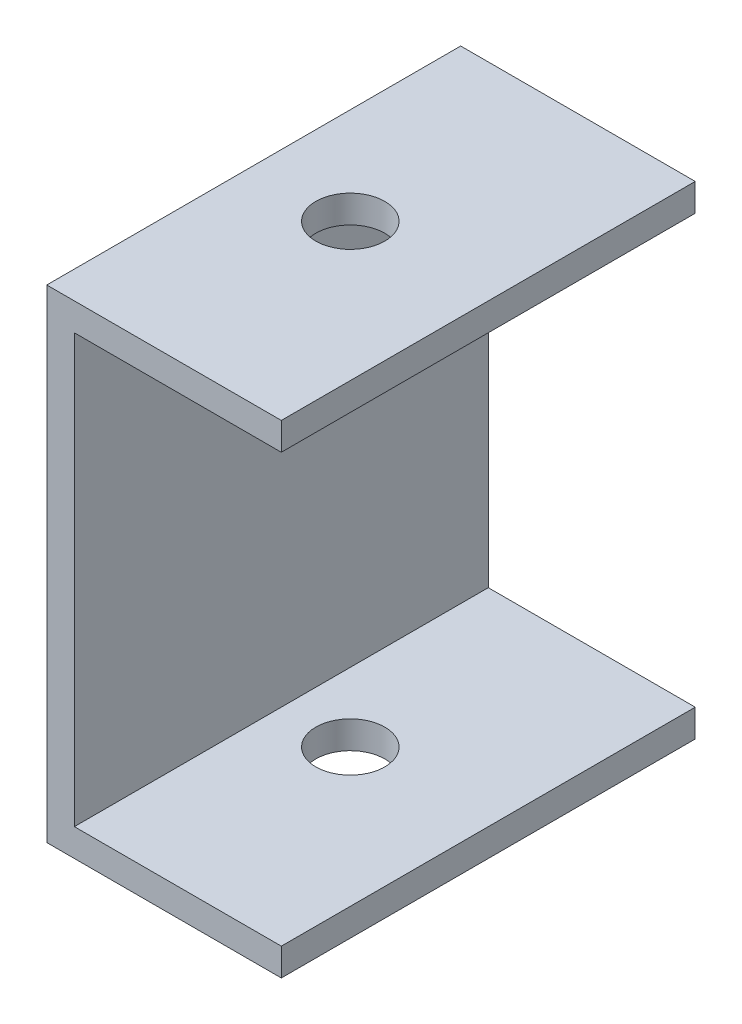
ISO-10303-21;
HEADER;
FILE_DESCRIPTION(('STEP AP214'),'2;1');
FILE_NAME('part.step','',(''),(''),'','','');
FILE_SCHEMA(('AUTOMOTIVE_DESIGN { 1 0 10303 214 1 1 1 1 }'));
ENDSEC;
DATA;
#1=APPLICATION_CONTEXT('core data for automotive mechanical design processes');
#2=APPLICATION_PROTOCOL_DEFINITION('international standard','automotive_design',2000,#1);
#3=PRODUCT_CONTEXT('',#1,'mechanical');
#4=PRODUCT('Part','Part','',(#3));
#5=PRODUCT_RELATED_PRODUCT_CATEGORY('part','',(#4));
#6=PRODUCT_DEFINITION_FORMATION('','',#4);
#7=PRODUCT_DEFINITION_CONTEXT('part definition',#1,'design');
#8=PRODUCT_DEFINITION('design','',#6,#7);
#9=PRODUCT_DEFINITION_SHAPE('','',#8);
#10=(LENGTH_UNIT() NAMED_UNIT(*) SI_UNIT(.MILLI.,.METRE.));
#11=(NAMED_UNIT(*) PLANE_ANGLE_UNIT() SI_UNIT($,.RADIAN.));
#12=(NAMED_UNIT(*) SI_UNIT($,.STERADIAN.) SOLID_ANGLE_UNIT());
#13=UNCERTAINTY_MEASURE_WITH_UNIT(LENGTH_MEASURE(1.E-05),#10,'distance_accuracy_value','');
#14=(GEOMETRIC_REPRESENTATION_CONTEXT(3) GLOBAL_UNCERTAINTY_ASSIGNED_CONTEXT((#13)) GLOBAL_UNIT_ASSIGNED_CONTEXT((#10,
#11,#12)) REPRESENTATION_CONTEXT('',''));
#15=CARTESIAN_POINT('',(0.,0.,0.));
#16=DIRECTION('',(0.,0.,1.));
#17=DIRECTION('',(1.,0.,0.));
#18=AXIS2_PLACEMENT_3D('',#15,#16,#17);
#19=CARTESIAN_POINT('',(17.,0.,30.));
#20=DIRECTION('',(0.,1.,0.));
#21=DIRECTION('',(-1.,0.,0.));
#22=AXIS2_PLACEMENT_3D('',#19,#20,#21);
#23=PLANE('',#22);
#24=CARTESIAN_POINT('',(7.,0.,15.));
#25=DIRECTION('',(0.,1.,0.));
#26=DIRECTION('',(-1.,0.,0.));
#27=AXIS2_PLACEMENT_3D('',#24,#25,#26);
#28=CIRCLE('',#27,2.5);
#29=CARTESIAN_POINT('',(4.5,0.,15.));
#30=VERTEX_POINT('',#29);
#31=EDGE_CURVE('E172',#30,#30,#28,.T.);
#32=ORIENTED_EDGE('',*,*,#31,.T.);
#33=EDGE_LOOP('',(#32));
#34=FACE_BOUND('',#33,.T.);
#35=DIRECTION('',(1.,0.,0.));
#36=VECTOR('',#35,1.);
#37=CARTESIAN_POINT('',(17.,0.,0.));
#38=LINE('',#37,#36);
#39=CARTESIAN_POINT('',(0.,0.,0.));
#40=VERTEX_POINT('',#39);
#41=CARTESIAN_POINT('',(17.,0.,0.));
#42=VERTEX_POINT('',#41);
#43=EDGE_CURVE('E176',#40,#42,#38,.T.);
#44=ORIENTED_EDGE('',*,*,#43,.T.);
#45=DIRECTION('',(0.,0.,-1.));
#46=VECTOR('',#45,1.);
#47=CARTESIAN_POINT('',(17.,0.,30.));
#48=LINE('',#47,#46);
#49=CARTESIAN_POINT('',(17.,0.,30.));
#50=VERTEX_POINT('',#49);
#51=EDGE_CURVE('E11',#50,#42,#48,.T.);
#52=ORIENTED_EDGE('',*,*,#51,.F.);
#53=DIRECTION('',(1.,0.,0.));
#54=VECTOR('',#53,1.);
#55=CARTESIAN_POINT('',(17.,0.,30.));
#56=LINE('',#55,#54);
#57=CARTESIAN_POINT('',(0.,0.,30.));
#58=VERTEX_POINT('',#57);
#59=EDGE_CURVE('E177',#58,#50,#56,.T.);
#60=ORIENTED_EDGE('',*,*,#59,.F.);
#61=DIRECTION('',(0.,0.,-1.));
#62=VECTOR('',#61,1.);
#63=CARTESIAN_POINT('',(0.,0.,30.));
#64=LINE('',#63,#62);
#65=EDGE_CURVE('E114',#58,#40,#64,.T.);
#66=ORIENTED_EDGE('',*,*,#65,.T.);
#67=EDGE_LOOP('',(#44,#52,#60,#66));
#68=FACE_BOUND('',#67,.T.);
#69=ADVANCED_FACE('F38',(#34,#68),#23,.F.);
#70=CARTESIAN_POINT('',(17.,2.,30.));
#71=DIRECTION('',(-1.,0.,0.));
#72=DIRECTION('',(0.,0.,1.));
#73=AXIS2_PLACEMENT_3D('',#70,#71,#72);
#74=PLANE('',#73);
#75=DIRECTION('',(0.,1.,0.));
#76=VECTOR('',#75,1.);
#77=CARTESIAN_POINT('',(17.,2.,0.));
#78=LINE('',#77,#76);
#79=CARTESIAN_POINT('',(17.,2.,0.));
#80=VERTEX_POINT('',#79);
#81=EDGE_CURVE('E190',#42,#80,#78,.T.);
#82=ORIENTED_EDGE('',*,*,#81,.T.);
#83=DIRECTION('',(0.,0.,-1.));
#84=VECTOR('',#83,1.);
#85=CARTESIAN_POINT('',(17.,2.,30.));
#86=LINE('',#85,#84);
#87=CARTESIAN_POINT('',(17.,2.,30.));
#88=VERTEX_POINT('',#87);
#89=EDGE_CURVE('E48',#88,#80,#86,.T.);
#90=ORIENTED_EDGE('',*,*,#89,.F.);
#91=DIRECTION('',(0.,1.,0.));
#92=VECTOR('',#91,1.);
#93=CARTESIAN_POINT('',(17.,2.,30.));
#94=LINE('',#93,#92);
#95=EDGE_CURVE('E89',#50,#88,#94,.T.);
#96=ORIENTED_EDGE('',*,*,#95,.F.);
#97=ORIENTED_EDGE('',*,*,#51,.T.);
#98=EDGE_LOOP('',(#82,#90,#96,#97));
#99=FACE_BOUND('',#98,.T.);
#100=ADVANCED_FACE('F226',(#99),#74,.F.);
#101=CARTESIAN_POINT('',(2.,2.,30.));
#102=DIRECTION('',(0.,-1.,0.));
#103=DIRECTION('',(1.,0.,0.));
#104=AXIS2_PLACEMENT_3D('',#101,#102,#103);
#105=PLANE('',#104);
#106=CARTESIAN_POINT('',(7.,2.,15.));
#107=DIRECTION('',(0.,1.,0.));
#108=DIRECTION('',(-1.,0.,0.));
#109=AXIS2_PLACEMENT_3D('',#106,#107,#108);
#110=CIRCLE('',#109,2.5);
#111=CARTESIAN_POINT('',(4.5,2.,15.));
#112=VERTEX_POINT('',#111);
#113=EDGE_CURVE('E168',#112,#112,#110,.T.);
#114=ORIENTED_EDGE('',*,*,#113,.F.);
#115=EDGE_LOOP('',(#114));
#116=FACE_BOUND('',#115,.T.);
#117=DIRECTION('',(-1.,0.,0.));
#118=VECTOR('',#117,1.);
#119=CARTESIAN_POINT('',(2.,2.,0.));
#120=LINE('',#119,#118);
#121=CARTESIAN_POINT('',(2.,2.,0.));
#122=VERTEX_POINT('',#121);
#123=EDGE_CURVE('E75',#80,#122,#120,.T.);
#124=ORIENTED_EDGE('',*,*,#123,.T.);
#125=DIRECTION('',(0.,0.,-1.));
#126=VECTOR('',#125,1.);
#127=CARTESIAN_POINT('',(2.,2.,30.));
#128=LINE('',#127,#126);
#129=CARTESIAN_POINT('',(2.,2.,30.));
#130=VERTEX_POINT('',#129);
#131=EDGE_CURVE('E202',#130,#122,#128,.T.);
#132=ORIENTED_EDGE('',*,*,#131,.F.);
#133=DIRECTION('',(-1.,0.,0.));
#134=VECTOR('',#133,1.);
#135=CARTESIAN_POINT('',(2.,2.,30.));
#136=LINE('',#135,#134);
#137=EDGE_CURVE('E182',#88,#130,#136,.T.);
#138=ORIENTED_EDGE('',*,*,#137,.F.);
#139=ORIENTED_EDGE('',*,*,#89,.T.);
#140=EDGE_LOOP('',(#124,#132,#138,#139));
#141=FACE_BOUND('',#140,.T.);
#142=ADVANCED_FACE('F207',(#116,#141),#105,.F.);
#143=CARTESIAN_POINT('',(2.,28.,30.));
#144=DIRECTION('',(-1.,0.,0.));
#145=DIRECTION('',(0.,-1.,0.));
#146=AXIS2_PLACEMENT_3D('',#143,#144,#145);
#147=PLANE('',#146);
#148=CARTESIAN_POINT('',(2.,23.,15.));
#149=DIRECTION('',(1.,0.,0.));
#150=DIRECTION('',(0.,1.,0.));
#151=AXIS2_PLACEMENT_3D('',#148,#149,#150);
#152=CIRCLE('',#151,2.5);
#153=CARTESIAN_POINT('',(2.,25.5,15.));
#154=VERTEX_POINT('',#153);
#155=EDGE_CURVE('E164',#154,#154,#152,.T.);
#156=ORIENTED_EDGE('',*,*,#155,.F.);
#157=EDGE_LOOP('',(#156));
#158=FACE_BOUND('',#157,.T.);
#159=DIRECTION('',(0.,1.,0.));
#160=VECTOR('',#159,1.);
#161=CARTESIAN_POINT('',(2.,28.,0.));
#162=LINE('',#161,#160);
#163=CARTESIAN_POINT('',(1.99999999999999,33.,0.));
#164=VERTEX_POINT('',#163);
#165=EDGE_CURVE('E195',#122,#164,#162,.T.);
#166=ORIENTED_EDGE('',*,*,#165,.T.);
#167=DIRECTION('',(0.,0.,-1.));
#168=VECTOR('',#167,1.);
#169=CARTESIAN_POINT('',(2.,33.,0.));
#170=LINE('',#169,#168);
#171=CARTESIAN_POINT('',(2.,33.,30.));
#172=VERTEX_POINT('',#171);
#173=EDGE_CURVE('E160',#172,#164,#170,.T.);
#174=ORIENTED_EDGE('',*,*,#173,.F.);
#175=DIRECTION('',(0.,1.,0.));
#176=VECTOR('',#175,1.);
#177=CARTESIAN_POINT('',(2.,28.,30.));
#178=LINE('',#177,#176);
#179=EDGE_CURVE('E117',#130,#172,#178,.T.);
#180=ORIENTED_EDGE('',*,*,#179,.F.);
#181=ORIENTED_EDGE('',*,*,#131,.T.);
#182=EDGE_LOOP('',(#166,#174,#180,#181));
#183=FACE_BOUND('',#182,.T.);
#184=ADVANCED_FACE('F215',(#158,#183),#147,.F.);
#185=CARTESIAN_POINT('',(0.,0.,30.));
#186=DIRECTION('',(1.,0.,0.));
#187=DIRECTION('',(0.,1.,0.));
#188=AXIS2_PLACEMENT_3D('',#185,#186,#187);
#189=PLANE('',#188);
#190=CARTESIAN_POINT('',(0.,23.,15.));
#191=DIRECTION('',(1.,0.,0.));
#192=DIRECTION('',(0.,1.,0.));
#193=AXIS2_PLACEMENT_3D('',#190,#191,#192);
#194=CIRCLE('',#193,2.5);
#195=CARTESIAN_POINT('',(0.,25.5,15.));
#196=VERTEX_POINT('',#195);
#197=EDGE_CURVE('E41',#196,#196,#194,.T.);
#198=ORIENTED_EDGE('',*,*,#197,.T.);
#199=EDGE_LOOP('',(#198));
#200=FACE_BOUND('',#199,.T.);
#201=DIRECTION('',(0.,-1.,0.));
#202=VECTOR('',#201,1.);
#203=CARTESIAN_POINT('',(0.,0.,0.));
#204=LINE('',#203,#202);
#205=CARTESIAN_POINT('',(0.,35.,0.));
#206=VERTEX_POINT('',#205);
#207=EDGE_CURVE('E82',#206,#40,#204,.T.);
#208=ORIENTED_EDGE('',*,*,#207,.T.);
#209=ORIENTED_EDGE('',*,*,#65,.F.);
#210=DIRECTION('',(0.,-1.,0.));
#211=VECTOR('',#210,1.);
#212=CARTESIAN_POINT('',(0.,0.,30.));
#213=LINE('',#212,#211);
#214=CARTESIAN_POINT('',(0.,35.,30.));
#215=VERTEX_POINT('',#214);
#216=EDGE_CURVE('E56',#215,#58,#213,.T.);
#217=ORIENTED_EDGE('',*,*,#216,.F.);
#218=DIRECTION('',(0.,0.,1.));
#219=VECTOR('',#218,1.);
#220=CARTESIAN_POINT('',(0.,35.,0.));
#221=LINE('',#220,#219);
#222=EDGE_CURVE('E113',#206,#215,#221,.T.);
#223=ORIENTED_EDGE('',*,*,#222,.F.);
#224=EDGE_LOOP('',(#208,#209,#217,#223));
#225=FACE_BOUND('',#224,.T.);
#226=ADVANCED_FACE('F111',(#200,#225),#189,.F.);
#227=CARTESIAN_POINT('',(0.,0.,30.));
#228=DIRECTION('',(0.,0.,-1.));
#229=DIRECTION('',(-1.,0.,0.));
#230=AXIS2_PLACEMENT_3D('',#227,#228,#229);
#231=PLANE('',#230);
#232=ORIENTED_EDGE('',*,*,#59,.T.);
#233=ORIENTED_EDGE('',*,*,#95,.T.);
#234=ORIENTED_EDGE('',*,*,#137,.T.);
#235=ORIENTED_EDGE('',*,*,#179,.T.);
#236=DIRECTION('',(1.,0.,0.));
#237=VECTOR('',#236,1.);
#238=CARTESIAN_POINT('',(17.,33.,30.));
#239=LINE('',#238,#237);
#240=CARTESIAN_POINT('',(17.,33.,30.));
#241=VERTEX_POINT('',#240);
#242=EDGE_CURVE('E149',#172,#241,#239,.T.);
#243=ORIENTED_EDGE('',*,*,#242,.T.);
#244=DIRECTION('',(0.,-1.,0.));
#245=VECTOR('',#244,1.);
#246=CARTESIAN_POINT('',(17.,35.,30.));
#247=LINE('',#246,#245);
#248=CARTESIAN_POINT('',(17.,35.,30.));
#249=VERTEX_POINT('',#248);
#250=EDGE_CURVE('E123',#249,#241,#247,.T.);
#251=ORIENTED_EDGE('',*,*,#250,.F.);
#252=DIRECTION('',(1.,0.,0.));
#253=VECTOR('',#252,1.);
#254=CARTESIAN_POINT('',(17.,35.,30.));
#255=LINE('',#254,#253);
#256=EDGE_CURVE('E120',#215,#249,#255,.T.);
#257=ORIENTED_EDGE('',*,*,#256,.F.);
#258=ORIENTED_EDGE('',*,*,#216,.T.);
#259=EDGE_LOOP('',(#232,#233,#234,#235,#243,#251,#257,#258));
#260=FACE_BOUND('',#259,.T.);
#261=ADVANCED_FACE('F121',(#260),#231,.F.);
#262=CARTESIAN_POINT('',(0.,0.,0.));
#263=DIRECTION('',(0.,0.,-1.));
#264=DIRECTION('',(-1.,0.,0.));
#265=AXIS2_PLACEMENT_3D('',#262,#263,#264);
#266=PLANE('',#265);
#267=ORIENTED_EDGE('',*,*,#43,.F.);
#268=ORIENTED_EDGE('',*,*,#207,.F.);
#269=DIRECTION('',(-1.,0.,0.));
#270=VECTOR('',#269,1.);
#271=CARTESIAN_POINT('',(17.,35.,0.));
#272=LINE('',#271,#270);
#273=CARTESIAN_POINT('',(17.,35.,0.));
#274=VERTEX_POINT('',#273);
#275=EDGE_CURVE('E132',#274,#206,#272,.T.);
#276=ORIENTED_EDGE('',*,*,#275,.F.);
#277=DIRECTION('',(0.,-1.,0.));
#278=VECTOR('',#277,1.);
#279=CARTESIAN_POINT('',(17.,35.,0.));
#280=LINE('',#279,#278);
#281=CARTESIAN_POINT('',(17.,33.,0.));
#282=VERTEX_POINT('',#281);
#283=EDGE_CURVE('E148',#274,#282,#280,.T.);
#284=ORIENTED_EDGE('',*,*,#283,.T.);
#285=DIRECTION('',(-1.,0.,0.));
#286=VECTOR('',#285,1.);
#287=CARTESIAN_POINT('',(17.,33.,0.));
#288=LINE('',#287,#286);
#289=EDGE_CURVE('E134',#282,#164,#288,.T.);
#290=ORIENTED_EDGE('',*,*,#289,.T.);
#291=ORIENTED_EDGE('',*,*,#165,.F.);
#292=ORIENTED_EDGE('',*,*,#123,.F.);
#293=ORIENTED_EDGE('',*,*,#81,.F.);
#294=EDGE_LOOP('',(#267,#268,#276,#284,#290,#291,#292,#293));
#295=FACE_BOUND('',#294,.T.);
#296=ADVANCED_FACE('F211',(#295),#266,.T.);
#297=CARTESIAN_POINT('',(7.,-8.,15.));
#298=DIRECTION('',(0.,1.,0.));
#299=DIRECTION('',(-1.,0.,0.));
#300=AXIS2_PLACEMENT_3D('',#297,#298,#299);
#301=CYLINDRICAL_SURFACE('',#300,2.5);
#302=ORIENTED_EDGE('',*,*,#113,.T.);
#303=EDGE_LOOP('',(#302));
#304=FACE_BOUND('',#303,.T.);
#305=ORIENTED_EDGE('',*,*,#31,.F.);
#306=EDGE_LOOP('',(#305));
#307=FACE_BOUND('',#306,.T.);
#308=ADVANCED_FACE('F244',(#304,#307),#301,.F.);
#309=CARTESIAN_POINT('',(-8.,23.,15.));
#310=DIRECTION('',(1.,0.,0.));
#311=DIRECTION('',(0.,1.,0.));
#312=AXIS2_PLACEMENT_3D('',#309,#310,#311);
#313=CYLINDRICAL_SURFACE('',#312,2.5);
#314=ORIENTED_EDGE('',*,*,#155,.T.);
#315=EDGE_LOOP('',(#314));
#316=FACE_BOUND('',#315,.T.);
#317=ORIENTED_EDGE('',*,*,#197,.F.);
#318=EDGE_LOOP('',(#317));
#319=FACE_BOUND('',#318,.T.);
#320=ADVANCED_FACE('F249',(#316,#319),#313,.F.);
#321=CARTESIAN_POINT('',(17.,35.,0.));
#322=DIRECTION('',(-1.,0.,0.));
#323=DIRECTION('',(0.,0.,1.));
#324=AXIS2_PLACEMENT_3D('',#321,#322,#323);
#325=PLANE('',#324);
#326=DIRECTION('',(0.,0.,-1.));
#327=VECTOR('',#326,1.);
#328=CARTESIAN_POINT('',(17.,33.,0.));
#329=LINE('',#328,#327);
#330=EDGE_CURVE('E138',#241,#282,#329,.T.);
#331=ORIENTED_EDGE('',*,*,#330,.T.);
#332=ORIENTED_EDGE('',*,*,#283,.F.);
#333=DIRECTION('',(0.,0.,-1.));
#334=VECTOR('',#333,1.);
#335=CARTESIAN_POINT('',(17.,35.,0.));
#336=LINE('',#335,#334);
#337=EDGE_CURVE('E127',#249,#274,#336,.T.);
#338=ORIENTED_EDGE('',*,*,#337,.F.);
#339=ORIENTED_EDGE('',*,*,#250,.T.);
#340=EDGE_LOOP('',(#331,#332,#338,#339));
#341=FACE_BOUND('',#340,.T.);
#342=ADVANCED_FACE('F222',(#341),#325,.F.);
#343=CARTESIAN_POINT('',(0.,35.,0.));
#344=DIRECTION('',(0.,-1.,0.));
#345=DIRECTION('',(0.,0.,-1.));
#346=AXIS2_PLACEMENT_3D('',#343,#344,#345);
#347=PLANE('',#346);
#348=CARTESIAN_POINT('',(7.,35.,15.));
#349=DIRECTION('',(0.,-1.,0.));
#350=DIRECTION('',(0.,0.,-1.));
#351=AXIS2_PLACEMENT_3D('',#348,#349,#350);
#352=CIRCLE('',#351,2.5);
#353=CARTESIAN_POINT('',(7.,35.,12.5));
#354=VERTEX_POINT('',#353);
#355=EDGE_CURVE('E152',#354,#354,#352,.T.);
#356=ORIENTED_EDGE('',*,*,#355,.T.);
#357=EDGE_LOOP('',(#356));
#358=FACE_BOUND('',#357,.T.);
#359=ORIENTED_EDGE('',*,*,#222,.T.);
#360=ORIENTED_EDGE('',*,*,#256,.T.);
#361=ORIENTED_EDGE('',*,*,#337,.T.);
#362=ORIENTED_EDGE('',*,*,#275,.T.);
#363=EDGE_LOOP('',(#359,#360,#361,#362));
#364=FACE_BOUND('',#363,.T.);
#365=ADVANCED_FACE('F130',(#358,#364),#347,.F.);
#366=CARTESIAN_POINT('',(0.,33.,0.));
#367=DIRECTION('',(0.,-1.,0.));
#368=DIRECTION('',(0.,0.,-1.));
#369=AXIS2_PLACEMENT_3D('',#366,#367,#368);
#370=PLANE('',#369);
#371=CARTESIAN_POINT('',(7.,33.,15.));
#372=DIRECTION('',(0.,-1.,0.));
#373=DIRECTION('',(0.,0.,-1.));
#374=AXIS2_PLACEMENT_3D('',#371,#372,#373);
#375=CIRCLE('',#374,2.5);
#376=CARTESIAN_POINT('',(7.,33.,12.5));
#377=VERTEX_POINT('',#376);
#378=EDGE_CURVE('E141',#377,#377,#375,.T.);
#379=ORIENTED_EDGE('',*,*,#378,.F.);
#380=EDGE_LOOP('',(#379));
#381=FACE_BOUND('',#380,.T.);
#382=ORIENTED_EDGE('',*,*,#242,.F.);
#383=ORIENTED_EDGE('',*,*,#173,.T.);
#384=ORIENTED_EDGE('',*,*,#289,.F.);
#385=ORIENTED_EDGE('',*,*,#330,.F.);
#386=EDGE_LOOP('',(#382,#383,#384,#385));
#387=FACE_BOUND('',#386,.T.);
#388=ADVANCED_FACE('F219',(#381,#387),#370,.T.);
#389=CARTESIAN_POINT('',(7.,35.,15.));
#390=DIRECTION('',(0.,-1.,0.));
#391=DIRECTION('',(0.,0.,-1.));
#392=AXIS2_PLACEMENT_3D('',#389,#390,#391);
#393=CYLINDRICAL_SURFACE('',#392,2.5);
#394=ORIENTED_EDGE('',*,*,#355,.F.);
#395=EDGE_LOOP('',(#394));
#396=FACE_BOUND('',#395,.T.);
#397=ORIENTED_EDGE('',*,*,#378,.T.);
#398=EDGE_LOOP('',(#397));
#399=FACE_BOUND('',#398,.T.);
#400=ADVANCED_FACE('F258',(#396,#399),#393,.F.);
#401=CLOSED_SHELL('',(#69,#100,#142,#184,#226,#261,#296,#308,#320,#342,#365,#388,#400));
#402=MANIFOLD_SOLID_BREP('B2',#401);
#403=ADVANCED_BREP_SHAPE_REPRESENTATION('',(#18,#402),#14);
#404=SHAPE_DEFINITION_REPRESENTATION(#9,#403);
ENDSEC;
END-ISO-10303-21;
